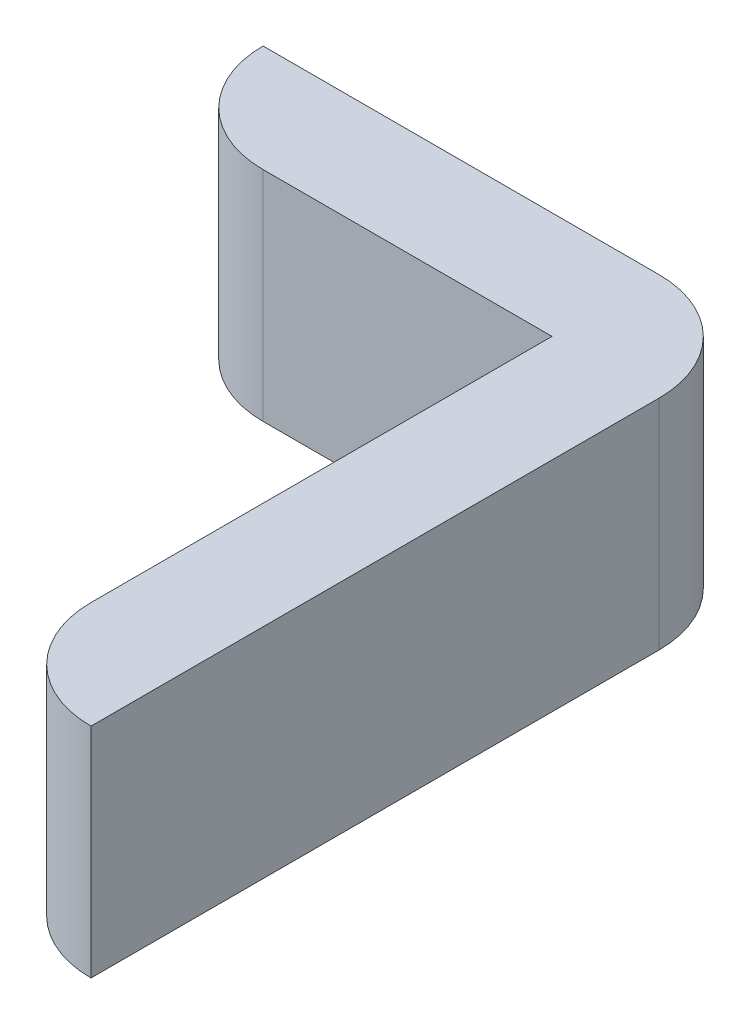
ISO-10303-21;
HEADER;
FILE_DESCRIPTION(('STEP AP214'),'2;1');
FILE_NAME('part.step','',(''),(''),'','','');
FILE_SCHEMA(('AUTOMOTIVE_DESIGN { 1 0 10303 214 1 1 1 1 }'));
ENDSEC;
DATA;
#1=APPLICATION_CONTEXT('core data for automotive mechanical design processes');
#2=APPLICATION_PROTOCOL_DEFINITION('international standard','automotive_design',2000,#1);
#3=PRODUCT_CONTEXT('',#1,'mechanical');
#4=PRODUCT('Part','Part','',(#3));
#5=PRODUCT_RELATED_PRODUCT_CATEGORY('part','',(#4));
#6=PRODUCT_DEFINITION_FORMATION('','',#4);
#7=PRODUCT_DEFINITION_CONTEXT('part definition',#1,'design');
#8=PRODUCT_DEFINITION('design','',#6,#7);
#9=PRODUCT_DEFINITION_SHAPE('','',#8);
#10=(LENGTH_UNIT() NAMED_UNIT(*) SI_UNIT(.MILLI.,.METRE.));
#11=(NAMED_UNIT(*) PLANE_ANGLE_UNIT() SI_UNIT($,.RADIAN.));
#12=(NAMED_UNIT(*) SI_UNIT($,.STERADIAN.) SOLID_ANGLE_UNIT());
#13=UNCERTAINTY_MEASURE_WITH_UNIT(LENGTH_MEASURE(1.E-05),#10,'distance_accuracy_value','');
#14=(GEOMETRIC_REPRESENTATION_CONTEXT(3) GLOBAL_UNCERTAINTY_ASSIGNED_CONTEXT((#13)) GLOBAL_UNIT_ASSIGNED_CONTEXT((#10,
#11,#12)) REPRESENTATION_CONTEXT('',''));
#15=CARTESIAN_POINT('',(0.,0.,0.));
#16=DIRECTION('',(0.,0.,1.));
#17=DIRECTION('',(1.,0.,0.));
#18=AXIS2_PLACEMENT_3D('',#15,#16,#17);
#19=CARTESIAN_POINT('',(9.275,-2.2852,0.));
#20=DIRECTION('',(0.,-1.,0.));
#21=DIRECTION('',(0.,0.,-1.));
#22=AXIS2_PLACEMENT_3D('',#19,#20,#21);
#23=PLANE('',#22);
#24=DIRECTION('',(-1.,0.,0.));
#25=VECTOR('',#24,1.);
#26=CARTESIAN_POINT('',(9.525,-2.2852,0.25));
#27=LINE('',#26,#25);
#28=CARTESIAN_POINT('',(9.525,-2.2852,0.25));
#29=VERTEX_POINT('',#28);
#30=CARTESIAN_POINT('',(10.2,-2.2852,0.25));
#31=VERTEX_POINT('',#30);
#32=EDGE_CURVE('E102',#29,#31,#27,.F.);
#33=ORIENTED_EDGE('',*,*,#32,.T.);
#34=DIRECTION('',(0.,0.,-1.));
#35=VECTOR('',#34,1.);
#36=CARTESIAN_POINT('',(10.2,-2.2852,0.25));
#37=LINE('',#36,#35);
#38=CARTESIAN_POINT('',(10.2,-2.2852,1.327));
#39=VERTEX_POINT('',#38);
#40=EDGE_CURVE('E108',#31,#39,#37,.F.);
#41=ORIENTED_EDGE('',*,*,#40,.T.);
#42=CARTESIAN_POINT('',(10.45,-2.2852,1.327));
#43=DIRECTION('',(0.,-1.,0.));
#44=DIRECTION('',(0.,0.,-1.));
#45=AXIS2_PLACEMENT_3D('',#42,#43,#44);
#46=CIRCLE('',#45,0.25);
#47=CARTESIAN_POINT('',(10.45,-2.2852,1.577));
#48=VERTEX_POINT('',#47);
#49=EDGE_CURVE('E80',#48,#39,#46,.T.);
#50=ORIENTED_EDGE('',*,*,#49,.F.);
#51=DIRECTION('',(0.,0.,1.));
#52=VECTOR('',#51,1.);
#53=CARTESIAN_POINT('',(10.45,-2.2852,1.577));
#54=LINE('',#53,#52);
#55=CARTESIAN_POINT('',(10.45,-2.2852,0.25));
#56=VERTEX_POINT('',#55);
#57=EDGE_CURVE('E75',#48,#56,#54,.F.);
#58=ORIENTED_EDGE('',*,*,#57,.T.);
#59=CARTESIAN_POINT('',(10.2,-2.2852,0.25));
#60=DIRECTION('',(0.,-1.,0.));
#61=DIRECTION('',(0.,0.,-1.));
#62=AXIS2_PLACEMENT_3D('',#59,#60,#61);
#63=CIRCLE('',#62,0.25);
#64=CARTESIAN_POINT('',(10.2,-2.2852,0.));
#65=VERTEX_POINT('',#64);
#66=EDGE_CURVE('E19',#65,#56,#63,.T.);
#67=ORIENTED_EDGE('',*,*,#66,.F.);
#68=DIRECTION('',(1.,0.,0.));
#69=VECTOR('',#68,1.);
#70=CARTESIAN_POINT('',(10.2,-2.2852,0.));
#71=LINE('',#70,#69);
#72=CARTESIAN_POINT('',(9.275,-2.2852,0.));
#73=VERTEX_POINT('',#72);
#74=EDGE_CURVE('E70',#65,#73,#71,.F.);
#75=ORIENTED_EDGE('',*,*,#74,.T.);
#76=CARTESIAN_POINT('',(9.525,-2.2852,0.));
#77=DIRECTION('',(0.,-1.,0.));
#78=DIRECTION('',(0.,0.,-1.));
#79=AXIS2_PLACEMENT_3D('',#76,#77,#78);
#80=CIRCLE('',#79,0.25);
#81=EDGE_CURVE('E121',#29,#73,#80,.T.);
#82=ORIENTED_EDGE('',*,*,#81,.F.);
#83=EDGE_LOOP('',(#33,#41,#50,#58,#67,#75,#82));
#84=FACE_BOUND('',#83,.T.);
#85=ADVANCED_FACE('F16',(#84),#23,.F.);
#86=CARTESIAN_POINT('',(10.2,-2.7948,0.));
#87=DIRECTION('',(0.,0.,1.));
#88=DIRECTION('',(1.,0.,0.));
#89=AXIS2_PLACEMENT_3D('',#86,#87,#88);
#90=PLANE('',#89);
#91=DIRECTION('',(0.,-1.,0.));
#92=VECTOR('',#91,1.);
#93=CARTESIAN_POINT('',(9.275,-2.7948,0.));
#94=LINE('',#93,#92);
#95=CARTESIAN_POINT('',(9.275,-2.7948,0.));
#96=VERTEX_POINT('',#95);
#97=EDGE_CURVE('E123',#73,#96,#94,.T.);
#98=ORIENTED_EDGE('',*,*,#97,.F.);
#99=ORIENTED_EDGE('',*,*,#74,.F.);
#100=DIRECTION('',(0.,-1.,0.));
#101=VECTOR('',#100,1.);
#102=CARTESIAN_POINT('',(10.2,-2.7948,0.));
#103=LINE('',#102,#101);
#104=CARTESIAN_POINT('',(10.2,-2.7948,0.));
#105=VERTEX_POINT('',#104);
#106=EDGE_CURVE('E92',#105,#65,#103,.F.);
#107=ORIENTED_EDGE('',*,*,#106,.F.);
#108=DIRECTION('',(1.,0.,0.));
#109=VECTOR('',#108,1.);
#110=CARTESIAN_POINT('',(9.275,-2.7948,0.));
#111=LINE('',#110,#109);
#112=EDGE_CURVE('E120',#96,#105,#111,.T.);
#113=ORIENTED_EDGE('',*,*,#112,.F.);
#114=EDGE_LOOP('',(#98,#99,#107,#113));
#115=FACE_BOUND('',#114,.T.);
#116=ADVANCED_FACE('F158',(#115),#90,.F.);
#117=CARTESIAN_POINT('',(10.2,-2.7948,0.25));
#118=DIRECTION('',(0.,-1.,0.));
#119=DIRECTION('',(0.,0.,-1.));
#120=AXIS2_PLACEMENT_3D('',#117,#118,#119);
#121=CYLINDRICAL_SURFACE('',#120,0.25);
#122=ORIENTED_EDGE('',*,*,#66,.T.);
#123=DIRECTION('',(0.,1.,0.));
#124=VECTOR('',#123,1.);
#125=CARTESIAN_POINT('',(10.45,-2.7948,0.25));
#126=LINE('',#125,#124);
#127=CARTESIAN_POINT('',(10.45,-2.7948,0.25));
#128=VERTEX_POINT('',#127);
#129=EDGE_CURVE('E86',#56,#128,#126,.F.);
#130=ORIENTED_EDGE('',*,*,#129,.T.);
#131=CARTESIAN_POINT('',(10.2,-2.7948,0.25));
#132=DIRECTION('',(0.,-1.,0.));
#133=DIRECTION('',(0.,0.,-1.));
#134=AXIS2_PLACEMENT_3D('',#131,#132,#133);
#135=CIRCLE('',#134,0.25);
#136=EDGE_CURVE('E118',#105,#128,#135,.T.);
#137=ORIENTED_EDGE('',*,*,#136,.F.);
#138=ORIENTED_EDGE('',*,*,#106,.T.);
#139=EDGE_LOOP('',(#122,#130,#137,#138));
#140=FACE_BOUND('',#139,.T.);
#141=ADVANCED_FACE('F89',(#140),#121,.T.);
#142=CARTESIAN_POINT('',(10.45,-2.7948,1.577));
#143=DIRECTION('',(-1.,0.,0.));
#144=DIRECTION('',(0.,0.,1.));
#145=AXIS2_PLACEMENT_3D('',#142,#143,#144);
#146=PLANE('',#145);
#147=DIRECTION('',(0.,-1.,0.));
#148=VECTOR('',#147,1.);
#149=CARTESIAN_POINT('',(10.45,-2.7948,1.577));
#150=LINE('',#149,#148);
#151=CARTESIAN_POINT('',(10.45,-2.7948,1.577));
#152=VERTEX_POINT('',#151);
#153=EDGE_CURVE('E85',#152,#48,#150,.F.);
#154=ORIENTED_EDGE('',*,*,#153,.F.);
#155=DIRECTION('',(0.,0.,-1.));
#156=VECTOR('',#155,1.);
#157=CARTESIAN_POINT('',(10.45,-2.7948,0.));
#158=LINE('',#157,#156);
#159=EDGE_CURVE('E94',#128,#152,#158,.F.);
#160=ORIENTED_EDGE('',*,*,#159,.F.);
#161=ORIENTED_EDGE('',*,*,#129,.F.);
#162=ORIENTED_EDGE('',*,*,#57,.F.);
#163=EDGE_LOOP('',(#154,#160,#161,#162));
#164=FACE_BOUND('',#163,.T.);
#165=ADVANCED_FACE('F93',(#164),#146,.F.);
#166=CARTESIAN_POINT('',(10.45,-2.7948,1.327));
#167=DIRECTION('',(0.,-1.,0.));
#168=DIRECTION('',(0.,0.,-1.));
#169=AXIS2_PLACEMENT_3D('',#166,#167,#168);
#170=CYLINDRICAL_SURFACE('',#169,0.25);
#171=ORIENTED_EDGE('',*,*,#49,.T.);
#172=DIRECTION('',(0.,1.,0.));
#173=VECTOR('',#172,1.);
#174=CARTESIAN_POINT('',(10.2,-2.7948,1.327));
#175=LINE('',#174,#173);
#176=CARTESIAN_POINT('',(10.2,-2.7948,1.327));
#177=VERTEX_POINT('',#176);
#178=EDGE_CURVE('E105',#39,#177,#175,.F.);
#179=ORIENTED_EDGE('',*,*,#178,.T.);
#180=CARTESIAN_POINT('',(10.45,-2.7948,1.327));
#181=DIRECTION('',(0.,-1.,0.));
#182=DIRECTION('',(0.,0.,-1.));
#183=AXIS2_PLACEMENT_3D('',#180,#181,#182);
#184=CIRCLE('',#183,0.25);
#185=EDGE_CURVE('E114',#152,#177,#184,.T.);
#186=ORIENTED_EDGE('',*,*,#185,.F.);
#187=ORIENTED_EDGE('',*,*,#153,.T.);
#188=EDGE_LOOP('',(#171,#179,#186,#187));
#189=FACE_BOUND('',#188,.T.);
#190=ADVANCED_FACE('F127',(#189),#170,.T.);
#191=CARTESIAN_POINT('',(10.2,-2.7948,0.25));
#192=DIRECTION('',(1.,0.,0.));
#193=DIRECTION('',(0.,0.,-1.));
#194=AXIS2_PLACEMENT_3D('',#191,#192,#193);
#195=PLANE('',#194);
#196=ORIENTED_EDGE('',*,*,#178,.F.);
#197=ORIENTED_EDGE('',*,*,#40,.F.);
#198=DIRECTION('',(0.,1.,0.));
#199=VECTOR('',#198,1.);
#200=CARTESIAN_POINT('',(10.2,-2.7948,0.25));
#201=LINE('',#200,#199);
#202=CARTESIAN_POINT('',(10.2,-2.7948,0.25));
#203=VERTEX_POINT('',#202);
#204=EDGE_CURVE('E104',#31,#203,#201,.F.);
#205=ORIENTED_EDGE('',*,*,#204,.T.);
#206=DIRECTION('',(0.,0.,-1.));
#207=VECTOR('',#206,1.);
#208=CARTESIAN_POINT('',(10.2,-2.7948,0.));
#209=LINE('',#208,#207);
#210=EDGE_CURVE('E117',#177,#203,#209,.T.);
#211=ORIENTED_EDGE('',*,*,#210,.F.);
#212=EDGE_LOOP('',(#196,#197,#205,#211));
#213=FACE_BOUND('',#212,.T.);
#214=ADVANCED_FACE('F150',(#213),#195,.F.);
#215=CARTESIAN_POINT('',(9.525,-2.7948,0.25));
#216=DIRECTION('',(0.,0.,-1.));
#217=DIRECTION('',(-1.,0.,0.));
#218=AXIS2_PLACEMENT_3D('',#215,#216,#217);
#219=PLANE('',#218);
#220=ORIENTED_EDGE('',*,*,#204,.F.);
#221=ORIENTED_EDGE('',*,*,#32,.F.);
#222=DIRECTION('',(0.,-1.,0.));
#223=VECTOR('',#222,1.);
#224=CARTESIAN_POINT('',(9.525,-2.7948,0.25));
#225=LINE('',#224,#223);
#226=CARTESIAN_POINT('',(9.525,-2.7948,0.25));
#227=VERTEX_POINT('',#226);
#228=EDGE_CURVE('E34',#227,#29,#225,.F.);
#229=ORIENTED_EDGE('',*,*,#228,.F.);
#230=DIRECTION('',(1.,0.,0.));
#231=VECTOR('',#230,1.);
#232=CARTESIAN_POINT('',(9.275,-2.7948,0.25));
#233=LINE('',#232,#231);
#234=EDGE_CURVE('E25',#203,#227,#233,.F.);
#235=ORIENTED_EDGE('',*,*,#234,.F.);
#236=EDGE_LOOP('',(#220,#221,#229,#235));
#237=FACE_BOUND('',#236,.T.);
#238=ADVANCED_FACE('F151',(#237),#219,.F.);
#239=CARTESIAN_POINT('',(9.525,-2.7948,0.));
#240=DIRECTION('',(0.,-1.,0.));
#241=DIRECTION('',(0.,0.,-1.));
#242=AXIS2_PLACEMENT_3D('',#239,#240,#241);
#243=CYLINDRICAL_SURFACE('',#242,0.25);
#244=ORIENTED_EDGE('',*,*,#81,.T.);
#245=ORIENTED_EDGE('',*,*,#97,.T.);
#246=CARTESIAN_POINT('',(9.525,-2.7948,0.));
#247=DIRECTION('',(0.,-1.,0.));
#248=DIRECTION('',(0.,0.,-1.));
#249=AXIS2_PLACEMENT_3D('',#246,#247,#248);
#250=CIRCLE('',#249,0.25);
#251=EDGE_CURVE('E11',#227,#96,#250,.T.);
#252=ORIENTED_EDGE('',*,*,#251,.F.);
#253=ORIENTED_EDGE('',*,*,#228,.T.);
#254=EDGE_LOOP('',(#244,#245,#252,#253));
#255=FACE_BOUND('',#254,.T.);
#256=ADVANCED_FACE('F156',(#255),#243,.T.);
#257=CARTESIAN_POINT('',(9.275,-2.7948,0.));
#258=DIRECTION('',(0.,-1.,0.));
#259=DIRECTION('',(0.,0.,-1.));
#260=AXIS2_PLACEMENT_3D('',#257,#258,#259);
#261=PLANE('',#260);
#262=ORIENTED_EDGE('',*,*,#234,.T.);
#263=ORIENTED_EDGE('',*,*,#251,.T.);
#264=ORIENTED_EDGE('',*,*,#112,.T.);
#265=ORIENTED_EDGE('',*,*,#136,.T.);
#266=ORIENTED_EDGE('',*,*,#159,.T.);
#267=ORIENTED_EDGE('',*,*,#185,.T.);
#268=ORIENTED_EDGE('',*,*,#210,.T.);
#269=EDGE_LOOP('',(#262,#263,#264,#265,#266,#267,#268));
#270=FACE_BOUND('',#269,.T.);
#271=ADVANCED_FACE('F132',(#270),#261,.T.);
#272=CLOSED_SHELL('',(#85,#116,#141,#165,#190,#214,#238,#256,#271));
#273=MANIFOLD_SOLID_BREP('B1',#272);
#274=ADVANCED_BREP_SHAPE_REPRESENTATION('',(#18,#273),#14);
#275=SHAPE_DEFINITION_REPRESENTATION(#9,#274);
ENDSEC;
END-ISO-10303-21;
